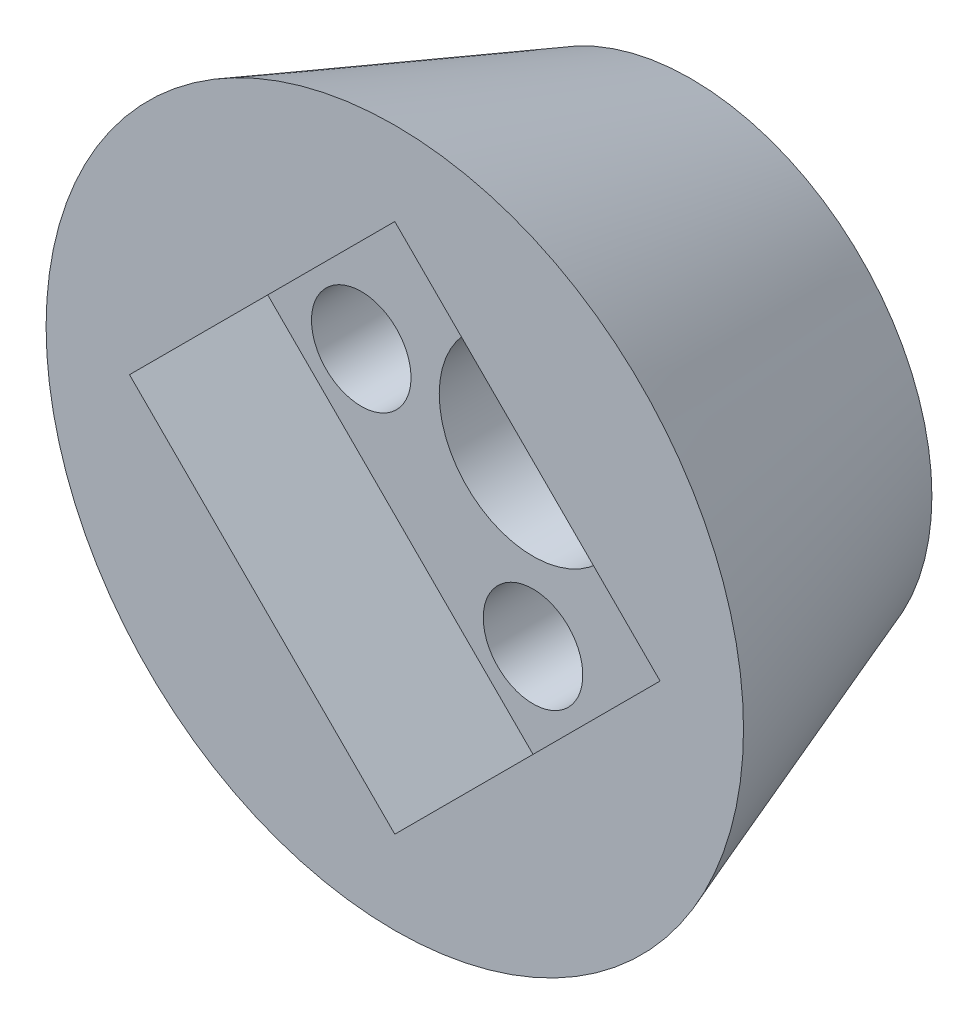
ISO-10303-21;
HEADER;
FILE_DESCRIPTION(('STEP AP214'),'2;1');
FILE_NAME('part.step','',(''),(''),'','','');
FILE_SCHEMA(('AUTOMOTIVE_DESIGN { 1 0 10303 214 1 1 1 1 }'));
ENDSEC;
DATA;
#1=APPLICATION_CONTEXT('core data for automotive mechanical design processes');
#2=APPLICATION_PROTOCOL_DEFINITION('international standard','automotive_design',2000,#1);
#3=PRODUCT_CONTEXT('',#1,'mechanical');
#4=PRODUCT('Part','Part','',(#3));
#5=PRODUCT_RELATED_PRODUCT_CATEGORY('part','',(#4));
#6=PRODUCT_DEFINITION_FORMATION('','',#4);
#7=PRODUCT_DEFINITION_CONTEXT('part definition',#1,'design');
#8=PRODUCT_DEFINITION('design','',#6,#7);
#9=PRODUCT_DEFINITION_SHAPE('','',#8);
#10=(LENGTH_UNIT() NAMED_UNIT(*) SI_UNIT(.MILLI.,.METRE.));
#11=(NAMED_UNIT(*) PLANE_ANGLE_UNIT() SI_UNIT($,.RADIAN.));
#12=(NAMED_UNIT(*) SI_UNIT($,.STERADIAN.) SOLID_ANGLE_UNIT());
#13=UNCERTAINTY_MEASURE_WITH_UNIT(LENGTH_MEASURE(1.E-05),#10,'distance_accuracy_value','');
#14=(GEOMETRIC_REPRESENTATION_CONTEXT(3) GLOBAL_UNCERTAINTY_ASSIGNED_CONTEXT((#13)) GLOBAL_UNIT_ASSIGNED_CONTEXT((#10,
#11,#12)) REPRESENTATION_CONTEXT('',''));
#15=CARTESIAN_POINT('',(0.,0.,0.));
#16=DIRECTION('',(0.,0.,1.));
#17=DIRECTION('',(1.,0.,0.));
#18=AXIS2_PLACEMENT_3D('',#15,#16,#17);
#19=CARTESIAN_POINT('',(0.,0.,0.));
#20=DIRECTION('',(0.,0.,1.));
#21=DIRECTION('',(1.,0.,0.));
#22=AXIS2_PLACEMENT_3D('',#19,#20,#21);
#23=CONICAL_SURFACE('',#22,12.2,0.349065850398867);
#24=CARTESIAN_POINT('',(0.,0.,15.));
#25=DIRECTION('',(0.,0.,1.));
#26=DIRECTION('',(1.,0.,0.));
#27=AXIS2_PLACEMENT_3D('',#24,#25,#26);
#28=CIRCLE('',#27,17.659553513993);
#29=CARTESIAN_POINT('',(17.659553513993,0.,15.));
#30=VERTEX_POINT('',#29);
#31=EDGE_CURVE('E11',#30,#30,#28,.T.);
#32=ORIENTED_EDGE('',*,*,#31,.F.);
#33=EDGE_LOOP('',(#32));
#34=FACE_BOUND('',#33,.T.);
#35=CARTESIAN_POINT('',(0.,0.,0.));
#36=DIRECTION('',(0.,0.,1.));
#37=DIRECTION('',(1.,0.,0.));
#38=AXIS2_PLACEMENT_3D('',#35,#36,#37);
#39=CIRCLE('',#38,12.2);
#40=CARTESIAN_POINT('',(12.2,0.,0.));
#41=VERTEX_POINT('',#40);
#42=EDGE_CURVE('E43',#41,#41,#39,.T.);
#43=ORIENTED_EDGE('',*,*,#42,.T.);
#44=EDGE_LOOP('',(#43));
#45=FACE_BOUND('',#44,.T.);
#46=ADVANCED_FACE('F35',(#34,#45),#23,.T.);
#47=CARTESIAN_POINT('',(0.,0.,15.));
#48=DIRECTION('',(0.,0.,1.));
#49=DIRECTION('',(1.,0.,0.));
#50=AXIS2_PLACEMENT_3D('',#47,#48,#49);
#51=PLANE('',#50);
#52=DIRECTION('',(-0.707106781186547,-0.707106781186548,0.));
#53=VECTOR('',#52,1.);
#54=CARTESIAN_POINT('',(-13.4350288425444,0.,15.));
#55=LINE('',#54,#53);
#56=CARTESIAN_POINT('',(0.,13.4350288425444,15.));
#57=VERTEX_POINT('',#56);
#58=CARTESIAN_POINT('',(-13.4350288425444,0.,15.));
#59=VERTEX_POINT('',#58);
#60=EDGE_CURVE('E50',#57,#59,#55,.T.);
#61=ORIENTED_EDGE('',*,*,#60,.F.);
#62=DIRECTION('',(-0.707106781186548,0.707106781186548,0.));
#63=VECTOR('',#62,1.);
#64=CARTESIAN_POINT('',(0.,13.4350288425444,15.));
#65=LINE('',#64,#63);
#66=CARTESIAN_POINT('',(13.4350288425444,0.,15.));
#67=VERTEX_POINT('',#66);
#68=EDGE_CURVE('E102',#67,#57,#65,.T.);
#69=ORIENTED_EDGE('',*,*,#68,.F.);
#70=DIRECTION('',(0.707106781186548,0.707106781186548,0.));
#71=VECTOR('',#70,1.);
#72=CARTESIAN_POINT('',(13.4350288425444,0.,15.));
#73=LINE('',#72,#71);
#74=CARTESIAN_POINT('',(0.,-13.4350288425444,15.));
#75=VERTEX_POINT('',#74);
#76=EDGE_CURVE('E108',#75,#67,#73,.T.);
#77=ORIENTED_EDGE('',*,*,#76,.F.);
#78=DIRECTION('',(0.707106781186548,-0.707106781186548,0.));
#79=VECTOR('',#78,1.);
#80=CARTESIAN_POINT('',(0.,-13.4350288425444,15.));
#81=LINE('',#80,#79);
#82=EDGE_CURVE('E85',#59,#75,#81,.T.);
#83=ORIENTED_EDGE('',*,*,#82,.F.);
#84=EDGE_LOOP('',(#61,#69,#77,#83));
#85=FACE_BOUND('',#84,.T.);
#86=ORIENTED_EDGE('',*,*,#31,.T.);
#87=EDGE_LOOP('',(#86));
#88=FACE_BOUND('',#87,.T.);
#89=ADVANCED_FACE('F148',(#85,#88),#51,.T.);
#90=CARTESIAN_POINT('',(0.,0.,0.));
#91=DIRECTION('',(0.,0.,1.));
#92=DIRECTION('',(1.,0.,0.));
#93=AXIS2_PLACEMENT_3D('',#90,#91,#92);
#94=PLANE('',#93);
#95=CARTESIAN_POINT('',(8.7,0.,0.));
#96=DIRECTION('',(0.,0.,-1.));
#97=DIRECTION('',(-1.,0.,0.));
#98=AXIS2_PLACEMENT_3D('',#95,#96,#97);
#99=CIRCLE('',#98,2.52);
#100=CARTESIAN_POINT('',(6.18,0.,0.));
#101=VERTEX_POINT('',#100);
#102=EDGE_CURVE('E126',#101,#101,#99,.T.);
#103=ORIENTED_EDGE('',*,*,#102,.F.);
#104=EDGE_LOOP('',(#103));
#105=FACE_BOUND('',#104,.T.);
#106=CARTESIAN_POINT('',(0.,-8.7,0.));
#107=DIRECTION('',(0.,0.,-1.));
#108=DIRECTION('',(-1.,0.,0.));
#109=AXIS2_PLACEMENT_3D('',#106,#107,#108);
#110=CIRCLE('',#109,2.52);
#111=CARTESIAN_POINT('',(-2.52,-8.7,0.));
#112=VERTEX_POINT('',#111);
#113=EDGE_CURVE('E129',#112,#112,#110,.T.);
#114=ORIENTED_EDGE('',*,*,#113,.F.);
#115=EDGE_LOOP('',(#114));
#116=FACE_BOUND('',#115,.T.);
#117=CARTESIAN_POINT('',(-8.7,0.,0.));
#118=DIRECTION('',(0.,0.,-1.));
#119=DIRECTION('',(-1.,0.,0.));
#120=AXIS2_PLACEMENT_3D('',#117,#118,#119);
#121=CIRCLE('',#120,2.52);
#122=CARTESIAN_POINT('',(-11.22,0.,0.));
#123=VERTEX_POINT('',#122);
#124=EDGE_CURVE('E132',#123,#123,#121,.T.);
#125=ORIENTED_EDGE('',*,*,#124,.F.);
#126=EDGE_LOOP('',(#125));
#127=FACE_BOUND('',#126,.T.);
#128=CARTESIAN_POINT('',(0.,8.7,0.));
#129=DIRECTION('',(0.,0.,-1.));
#130=DIRECTION('',(-1.,0.,0.));
#131=AXIS2_PLACEMENT_3D('',#128,#129,#130);
#132=CIRCLE('',#131,2.52);
#133=CARTESIAN_POINT('',(-2.52,8.7,0.));
#134=VERTEX_POINT('',#133);
#135=EDGE_CURVE('E135',#134,#134,#132,.T.);
#136=ORIENTED_EDGE('',*,*,#135,.F.);
#137=EDGE_LOOP('',(#136));
#138=FACE_BOUND('',#137,.T.);
#139=CARTESIAN_POINT('',(0.,0.,0.));
#140=DIRECTION('',(0.,0.,-1.));
#141=DIRECTION('',(-1.,0.,0.));
#142=AXIS2_PLACEMENT_3D('',#139,#140,#141);
#143=CIRCLE('',#142,4.75);
#144=CARTESIAN_POINT('',(-4.75,0.,0.));
#145=VERTEX_POINT('',#144);
#146=EDGE_CURVE('E138',#145,#145,#143,.T.);
#147=ORIENTED_EDGE('',*,*,#146,.F.);
#148=EDGE_LOOP('',(#147));
#149=FACE_BOUND('',#148,.T.);
#150=ORIENTED_EDGE('',*,*,#42,.F.);
#151=EDGE_LOOP('',(#150));
#152=FACE_BOUND('',#151,.T.);
#153=ADVANCED_FACE('F145',(#105,#116,#127,#138,#149,#152),#94,.F.);
#154=CARTESIAN_POINT('',(0.,0.,15.));
#155=DIRECTION('',(0.,0.,-1.));
#156=DIRECTION('',(-1.,0.,0.));
#157=AXIS2_PLACEMENT_3D('',#154,#155,#156);
#158=CYLINDRICAL_SURFACE('',#157,4.75);
#159=CARTESIAN_POINT('',(0.,0.,8.));
#160=DIRECTION('',(0.,0.,-1.));
#161=DIRECTION('',(-1.,0.,0.));
#162=AXIS2_PLACEMENT_3D('',#159,#160,#161);
#163=CIRCLE('',#162,4.75);
#164=CARTESIAN_POINT('',(-4.75,0.,8.));
#165=VERTEX_POINT('',#164);
#166=EDGE_CURVE('E123',#165,#165,#163,.F.);
#167=ORIENTED_EDGE('',*,*,#166,.T.);
#168=EDGE_LOOP('',(#167));
#169=FACE_BOUND('',#168,.T.);
#170=ORIENTED_EDGE('',*,*,#146,.T.);
#171=EDGE_LOOP('',(#170));
#172=FACE_BOUND('',#171,.T.);
#173=ADVANCED_FACE('F147',(#169,#172),#158,.F.);
#174=CARTESIAN_POINT('',(0.,8.7,15.));
#175=DIRECTION('',(0.,0.,-1.));
#176=DIRECTION('',(-1.,0.,0.));
#177=AXIS2_PLACEMENT_3D('',#174,#175,#176);
#178=CYLINDRICAL_SURFACE('',#177,2.52);
#179=CARTESIAN_POINT('',(0.,8.7,8.));
#180=DIRECTION('',(0.,0.,-1.));
#181=DIRECTION('',(-1.,0.,0.));
#182=AXIS2_PLACEMENT_3D('',#179,#180,#181);
#183=CIRCLE('',#182,2.52);
#184=CARTESIAN_POINT('',(-2.52,8.7,8.));
#185=VERTEX_POINT('',#184);
#186=EDGE_CURVE('E120',#185,#185,#183,.F.);
#187=ORIENTED_EDGE('',*,*,#186,.T.);
#188=EDGE_LOOP('',(#187));
#189=FACE_BOUND('',#188,.T.);
#190=ORIENTED_EDGE('',*,*,#135,.T.);
#191=EDGE_LOOP('',(#190));
#192=FACE_BOUND('',#191,.T.);
#193=ADVANCED_FACE('F154',(#189,#192),#178,.F.);
#194=CARTESIAN_POINT('',(-8.7,0.,15.));
#195=DIRECTION('',(0.,0.,-1.));
#196=DIRECTION('',(-1.,0.,0.));
#197=AXIS2_PLACEMENT_3D('',#194,#195,#196);
#198=CYLINDRICAL_SURFACE('',#197,2.52);
#199=CARTESIAN_POINT('',(-8.7,0.,8.));
#200=DIRECTION('',(0.,0.,-1.));
#201=DIRECTION('',(-1.,0.,0.));
#202=AXIS2_PLACEMENT_3D('',#199,#200,#201);
#203=CIRCLE('',#202,2.52);
#204=CARTESIAN_POINT('',(-11.22,0.,8.));
#205=VERTEX_POINT('',#204);
#206=EDGE_CURVE('E117',#205,#205,#203,.F.);
#207=ORIENTED_EDGE('',*,*,#206,.T.);
#208=EDGE_LOOP('',(#207));
#209=FACE_BOUND('',#208,.T.);
#210=ORIENTED_EDGE('',*,*,#124,.T.);
#211=EDGE_LOOP('',(#210));
#212=FACE_BOUND('',#211,.T.);
#213=ADVANCED_FACE('F188',(#209,#212),#198,.F.);
#214=CARTESIAN_POINT('',(0.,-8.7,15.));
#215=DIRECTION('',(0.,0.,-1.));
#216=DIRECTION('',(-1.,0.,0.));
#217=AXIS2_PLACEMENT_3D('',#214,#215,#216);
#218=CYLINDRICAL_SURFACE('',#217,2.52);
#219=CARTESIAN_POINT('',(0.,-8.7,8.));
#220=DIRECTION('',(0.,0.,-1.));
#221=DIRECTION('',(-1.,0.,0.));
#222=AXIS2_PLACEMENT_3D('',#219,#220,#221);
#223=CIRCLE('',#222,2.52);
#224=CARTESIAN_POINT('',(-2.52,-8.7,8.));
#225=VERTEX_POINT('',#224);
#226=EDGE_CURVE('E114',#225,#225,#223,.F.);
#227=ORIENTED_EDGE('',*,*,#226,.T.);
#228=EDGE_LOOP('',(#227));
#229=FACE_BOUND('',#228,.T.);
#230=ORIENTED_EDGE('',*,*,#113,.T.);
#231=EDGE_LOOP('',(#230));
#232=FACE_BOUND('',#231,.T.);
#233=ADVANCED_FACE('F198',(#229,#232),#218,.F.);
#234=CARTESIAN_POINT('',(8.7,0.,15.));
#235=DIRECTION('',(0.,0.,-1.));
#236=DIRECTION('',(-1.,0.,0.));
#237=AXIS2_PLACEMENT_3D('',#234,#235,#236);
#238=CYLINDRICAL_SURFACE('',#237,2.52);
#239=CARTESIAN_POINT('',(8.7,0.,8.));
#240=DIRECTION('',(0.,0.,-1.));
#241=DIRECTION('',(-1.,0.,0.));
#242=AXIS2_PLACEMENT_3D('',#239,#240,#241);
#243=CIRCLE('',#242,2.52);
#244=CARTESIAN_POINT('',(6.18,0.,8.));
#245=VERTEX_POINT('',#244);
#246=EDGE_CURVE('E38',#245,#245,#243,.F.);
#247=ORIENTED_EDGE('',*,*,#246,.T.);
#248=EDGE_LOOP('',(#247));
#249=FACE_BOUND('',#248,.T.);
#250=ORIENTED_EDGE('',*,*,#102,.T.);
#251=EDGE_LOOP('',(#250));
#252=FACE_BOUND('',#251,.T.);
#253=ADVANCED_FACE('F208',(#249,#252),#238,.F.);
#254=CARTESIAN_POINT('',(0.,0.,8.));
#255=DIRECTION('',(0.,0.,-1.));
#256=DIRECTION('',(-1.,0.,0.));
#257=AXIS2_PLACEMENT_3D('',#254,#255,#256);
#258=PLANE('',#257);
#259=ORIENTED_EDGE('',*,*,#186,.F.);
#260=EDGE_LOOP('',(#259));
#261=FACE_BOUND('',#260,.T.);
#262=ORIENTED_EDGE('',*,*,#226,.F.);
#263=EDGE_LOOP('',(#262));
#264=FACE_BOUND('',#263,.T.);
#265=DIRECTION('',(-0.707106781186547,-0.707106781186548,0.));
#266=VECTOR('',#265,1.);
#267=CARTESIAN_POINT('',(-13.4350288425444,0.,8.));
#268=LINE('',#267,#266);
#269=CARTESIAN_POINT('',(0.,13.4350288425444,8.));
#270=VERTEX_POINT('',#269);
#271=CARTESIAN_POINT('',(-13.4350288425444,0.,8.));
#272=VERTEX_POINT('',#271);
#273=EDGE_CURVE('E100',#270,#272,#268,.T.);
#274=ORIENTED_EDGE('',*,*,#273,.T.);
#275=DIRECTION('',(0.707106781186548,-0.707106781186548,0.));
#276=VECTOR('',#275,1.);
#277=CARTESIAN_POINT('',(0.,-13.4350288425444,8.));
#278=LINE('',#277,#276);
#279=CARTESIAN_POINT('',(0.,-13.4350288425444,8.));
#280=VERTEX_POINT('',#279);
#281=EDGE_CURVE('E82',#272,#280,#278,.T.);
#282=ORIENTED_EDGE('',*,*,#281,.T.);
#283=DIRECTION('',(0.707106781186548,0.707106781186548,0.));
#284=VECTOR('',#283,1.);
#285=CARTESIAN_POINT('',(13.4350288425444,0.,8.));
#286=LINE('',#285,#284);
#287=CARTESIAN_POINT('',(13.4350288425444,0.,8.));
#288=VERTEX_POINT('',#287);
#289=EDGE_CURVE('E92',#280,#288,#286,.T.);
#290=ORIENTED_EDGE('',*,*,#289,.T.);
#291=DIRECTION('',(-0.707106781186548,0.707106781186548,0.));
#292=VECTOR('',#291,1.);
#293=CARTESIAN_POINT('',(0.,13.4350288425444,8.));
#294=LINE('',#293,#292);
#295=EDGE_CURVE('E96',#288,#270,#294,.T.);
#296=ORIENTED_EDGE('',*,*,#295,.T.);
#297=EDGE_LOOP('',(#274,#282,#290,#296));
#298=FACE_BOUND('',#297,.T.);
#299=ORIENTED_EDGE('',*,*,#246,.F.);
#300=EDGE_LOOP('',(#299));
#301=FACE_BOUND('',#300,.T.);
#302=ORIENTED_EDGE('',*,*,#206,.F.);
#303=EDGE_LOOP('',(#302));
#304=FACE_BOUND('',#303,.T.);
#305=ORIENTED_EDGE('',*,*,#166,.F.);
#306=EDGE_LOOP('',(#305));
#307=FACE_BOUND('',#306,.T.);
#308=ADVANCED_FACE('F98',(#261,#264,#298,#301,#304,#307),#258,.F.);
#309=CARTESIAN_POINT('',(-13.4350288425444,0.,8.));
#310=DIRECTION('',(-0.707106781186548,0.707106781186548,0.));
#311=DIRECTION('',(-0.707106781186547,-0.707106781186548,0.));
#312=AXIS2_PLACEMENT_3D('',#309,#310,#311);
#313=PLANE('',#312);
#314=ORIENTED_EDGE('',*,*,#60,.T.);
#315=DIRECTION('',(0.,0.,1.));
#316=VECTOR('',#315,1.);
#317=CARTESIAN_POINT('',(-13.4350288425444,0.,8.));
#318=LINE('',#317,#316);
#319=EDGE_CURVE('E73',#272,#59,#318,.T.);
#320=ORIENTED_EDGE('',*,*,#319,.F.);
#321=ORIENTED_EDGE('',*,*,#273,.F.);
#322=DIRECTION('',(0.,0.,1.));
#323=VECTOR('',#322,1.);
#324=CARTESIAN_POINT('',(0.,13.4350288425444,8.));
#325=LINE('',#324,#323);
#326=EDGE_CURVE('E58',#270,#57,#325,.T.);
#327=ORIENTED_EDGE('',*,*,#326,.T.);
#328=EDGE_LOOP('',(#314,#320,#321,#327));
#329=FACE_BOUND('',#328,.T.);
#330=ADVANCED_FACE('F227',(#329),#313,.F.);
#331=CARTESIAN_POINT('',(0.,13.4350288425444,8.));
#332=DIRECTION('',(0.707106781186547,0.707106781186547,0.));
#333=DIRECTION('',(-0.707106781186548,0.707106781186548,0.));
#334=AXIS2_PLACEMENT_3D('',#331,#332,#333);
#335=PLANE('',#334);
#336=ORIENTED_EDGE('',*,*,#68,.T.);
#337=ORIENTED_EDGE('',*,*,#326,.F.);
#338=ORIENTED_EDGE('',*,*,#295,.F.);
#339=DIRECTION('',(0.,0.,1.));
#340=VECTOR('',#339,1.);
#341=CARTESIAN_POINT('',(13.4350288425444,0.,8.));
#342=LINE('',#341,#340);
#343=EDGE_CURVE('E89',#288,#67,#342,.T.);
#344=ORIENTED_EDGE('',*,*,#343,.T.);
#345=EDGE_LOOP('',(#336,#337,#338,#344));
#346=FACE_BOUND('',#345,.T.);
#347=ADVANCED_FACE('F237',(#346),#335,.F.);
#348=CARTESIAN_POINT('',(13.4350288425444,0.,8.));
#349=DIRECTION('',(0.707106781186547,-0.707106781186547,0.));
#350=DIRECTION('',(0.707106781186548,0.707106781186548,0.));
#351=AXIS2_PLACEMENT_3D('',#348,#349,#350);
#352=PLANE('',#351);
#353=ORIENTED_EDGE('',*,*,#76,.T.);
#354=ORIENTED_EDGE('',*,*,#343,.F.);
#355=ORIENTED_EDGE('',*,*,#289,.F.);
#356=DIRECTION('',(0.,0.,1.));
#357=VECTOR('',#356,1.);
#358=CARTESIAN_POINT('',(0.,-13.4350288425444,8.));
#359=LINE('',#358,#357);
#360=EDGE_CURVE('E78',#280,#75,#359,.T.);
#361=ORIENTED_EDGE('',*,*,#360,.T.);
#362=EDGE_LOOP('',(#353,#354,#355,#361));
#363=FACE_BOUND('',#362,.T.);
#364=ADVANCED_FACE('F93',(#363),#352,.F.);
#365=CARTESIAN_POINT('',(0.,-13.4350288425444,8.));
#366=DIRECTION('',(-0.707106781186547,-0.707106781186547,0.));
#367=DIRECTION('',(0.707106781186548,-0.707106781186548,0.));
#368=AXIS2_PLACEMENT_3D('',#365,#366,#367);
#369=PLANE('',#368);
#370=ORIENTED_EDGE('',*,*,#82,.T.);
#371=ORIENTED_EDGE('',*,*,#360,.F.);
#372=ORIENTED_EDGE('',*,*,#281,.F.);
#373=ORIENTED_EDGE('',*,*,#319,.T.);
#374=EDGE_LOOP('',(#370,#371,#372,#373));
#375=FACE_BOUND('',#374,.T.);
#376=ADVANCED_FACE('F80',(#375),#369,.F.);
#377=CLOSED_SHELL('',(#46,#89,#153,#173,#193,#213,#233,#253,#308,#330,#347,#364,#376));
#378=MANIFOLD_SOLID_BREP('B2',#377);
#379=ADVANCED_BREP_SHAPE_REPRESENTATION('',(#18,#378),#14);
#380=SHAPE_DEFINITION_REPRESENTATION(#9,#379);
ENDSEC;
END-ISO-10303-21;
